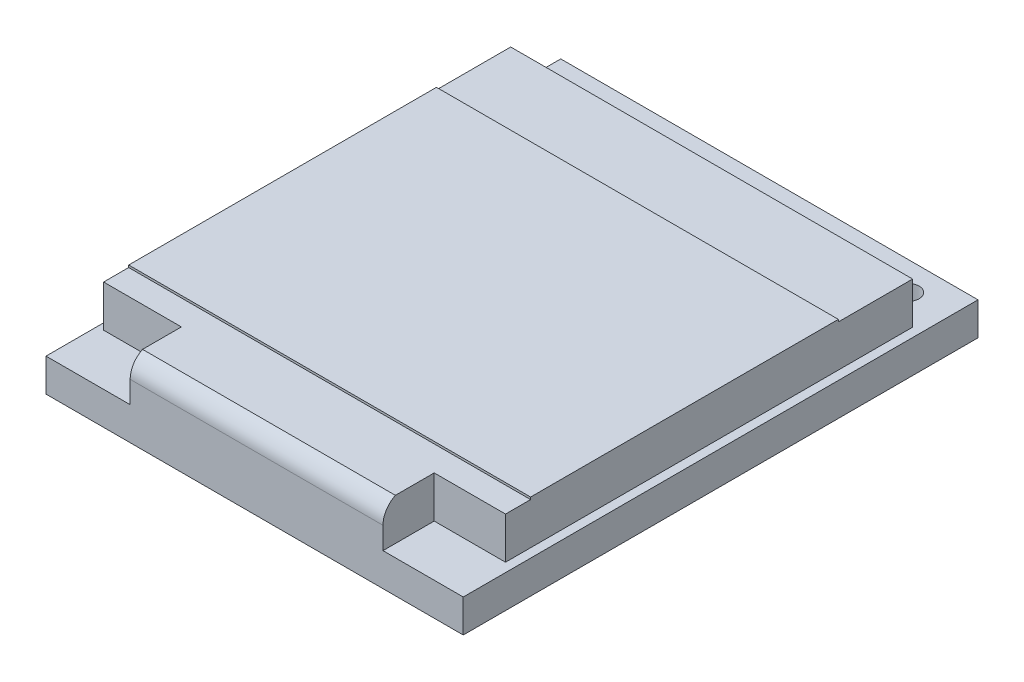
ISO-10303-21;
HEADER;
FILE_DESCRIPTION(('STEP AP214'),'2;1');
FILE_NAME('part.step','',(''),(''),'','','');
FILE_SCHEMA(('AUTOMOTIVE_DESIGN { 1 0 10303 214 1 1 1 1 }'));
ENDSEC;
DATA;
#1=APPLICATION_CONTEXT('core data for automotive mechanical design processes');
#2=APPLICATION_PROTOCOL_DEFINITION('international standard','automotive_design',2000,#1);
#3=PRODUCT_CONTEXT('',#1,'mechanical');
#4=PRODUCT('Part','Part','',(#3));
#5=PRODUCT_RELATED_PRODUCT_CATEGORY('part','',(#4));
#6=PRODUCT_DEFINITION_FORMATION('','',#4);
#7=PRODUCT_DEFINITION_CONTEXT('part definition',#1,'design');
#8=PRODUCT_DEFINITION('design','',#6,#7);
#9=PRODUCT_DEFINITION_SHAPE('','',#8);
#10=(LENGTH_UNIT() NAMED_UNIT(*) SI_UNIT(.MILLI.,.METRE.));
#11=(NAMED_UNIT(*) PLANE_ANGLE_UNIT() SI_UNIT($,.RADIAN.));
#12=(NAMED_UNIT(*) SI_UNIT($,.STERADIAN.) SOLID_ANGLE_UNIT());
#13=UNCERTAINTY_MEASURE_WITH_UNIT(LENGTH_MEASURE(1.E-05),#10,'distance_accuracy_value','');
#14=(GEOMETRIC_REPRESENTATION_CONTEXT(3) GLOBAL_UNCERTAINTY_ASSIGNED_CONTEXT((#13)) GLOBAL_UNIT_ASSIGNED_CONTEXT((#10,
#11,#12)) REPRESENTATION_CONTEXT('',''));
#15=CARTESIAN_POINT('',(0.,0.,0.));
#16=DIRECTION('',(0.,0.,1.));
#17=DIRECTION('',(1.,0.,0.));
#18=AXIS2_PLACEMENT_3D('',#15,#16,#17);
#19=CARTESIAN_POINT('',(0.290127114769082,3.5,2.56916476146928));
#20=DIRECTION('',(0.,0.,1.));
#21=DIRECTION('',(1.,0.,0.));
#22=AXIS2_PLACEMENT_3D('',#19,#20,#21);
#23=PLANE('',#22);
#24=DIRECTION('',(-1.,0.,0.));
#25=VECTOR('',#24,1.);
#26=CARTESIAN_POINT('',(0.290127114769082,3.4,2.56916476146928));
#27=LINE('',#26,#25);
#28=CARTESIAN_POINT('',(18.5917975918305,3.4,2.56916476146928));
#29=VERTEX_POINT('',#28);
#30=CARTESIAN_POINT('',(0.290127114769082,3.4,2.56916476146928));
#31=VERTEX_POINT('',#30);
#32=EDGE_CURVE('E202',#29,#31,#27,.T.);
#33=ORIENTED_EDGE('',*,*,#32,.F.);
#34=DIRECTION('',(0.,-1.,0.));
#35=VECTOR('',#34,1.);
#36=CARTESIAN_POINT('',(18.5917975918305,3.5,2.56916476146928));
#37=LINE('',#36,#35);
#38=CARTESIAN_POINT('',(18.5917975918305,1.5,2.56916476146928));
#39=VERTEX_POINT('',#38);
#40=EDGE_CURVE('E235',#29,#39,#37,.T.);
#41=ORIENTED_EDGE('',*,*,#40,.T.);
#42=DIRECTION('',(-1.,0.,0.));
#43=VECTOR('',#42,1.);
#44=CARTESIAN_POINT('',(0.290127114769082,1.5,2.56916476146928));
#45=LINE('',#44,#43);
#46=CARTESIAN_POINT('',(0.290127114769082,1.5,2.56916476146928));
#47=VERTEX_POINT('',#46);
#48=EDGE_CURVE('E212',#39,#47,#45,.T.);
#49=ORIENTED_EDGE('',*,*,#48,.T.);
#50=DIRECTION('',(0.,-1.,0.));
#51=VECTOR('',#50,1.);
#52=CARTESIAN_POINT('',(0.290127114769082,3.5,2.56916476146928));
#53=LINE('',#52,#51);
#54=EDGE_CURVE('E214',#31,#47,#53,.T.);
#55=ORIENTED_EDGE('',*,*,#54,.F.);
#56=EDGE_LOOP('',(#33,#41,#49,#55));
#57=FACE_BOUND('',#56,.T.);
#58=ADVANCED_FACE('F38',(#57),#23,.F.);
#59=CARTESIAN_POINT('',(0.,1.5,0.));
#60=DIRECTION('',(0.,1.,0.));
#61=DIRECTION('',(0.,0.,1.));
#62=AXIS2_PLACEMENT_3D('',#59,#60,#61);
#63=PLANE('',#62);
#64=DIRECTION('',(0.,0.,-1.));
#65=VECTOR('',#64,1.);
#66=CARTESIAN_POINT('',(15.3447270233196,1.5,21.1069858253315));
#67=LINE('',#66,#65);
#68=CARTESIAN_POINT('',(15.3447270233196,1.5,23.44));
#69=VERTEX_POINT('',#68);
#70=CARTESIAN_POINT('',(15.3447270233196,1.5,21.1069858253315));
#71=VERTEX_POINT('',#70);
#72=EDGE_CURVE('E223',#69,#71,#67,.T.);
#73=ORIENTED_EDGE('',*,*,#72,.F.);
#74=DIRECTION('',(1.,0.,0.));
#75=VECTOR('',#74,1.);
#76=CARTESIAN_POINT('',(0.,1.5,23.44));
#77=LINE('',#76,#75);
#78=CARTESIAN_POINT('',(19.,1.5,23.44));
#79=VERTEX_POINT('',#78);
#80=EDGE_CURVE('E295',#69,#79,#77,.T.);
#81=ORIENTED_EDGE('',*,*,#80,.T.);
#82=DIRECTION('',(0.,0.,-1.));
#83=VECTOR('',#82,1.);
#84=CARTESIAN_POINT('',(19.,1.5,0.));
#85=LINE('',#84,#83);
#86=CARTESIAN_POINT('',(19.,1.5,0.));
#87=VERTEX_POINT('',#86);
#88=EDGE_CURVE('E300',#79,#87,#85,.T.);
#89=ORIENTED_EDGE('',*,*,#88,.T.);
#90=DIRECTION('',(-1.,0.,0.));
#91=VECTOR('',#90,1.);
#92=CARTESIAN_POINT('',(0.,1.5,0.));
#93=LINE('',#92,#91);
#94=CARTESIAN_POINT('',(0.,1.5,0.));
#95=VERTEX_POINT('',#94);
#96=EDGE_CURVE('E302',#87,#95,#93,.T.);
#97=ORIENTED_EDGE('',*,*,#96,.T.);
#98=DIRECTION('',(0.,0.,1.));
#99=VECTOR('',#98,1.);
#100=CARTESIAN_POINT('',(0.,1.5,0.));
#101=LINE('',#100,#99);
#102=CARTESIAN_POINT('',(0.,1.5,23.44));
#103=VERTEX_POINT('',#102);
#104=EDGE_CURVE('E292',#95,#103,#101,.T.);
#105=ORIENTED_EDGE('',*,*,#104,.T.);
#106=CARTESIAN_POINT('',(3.83238591678098,1.5,23.44));
#107=VERTEX_POINT('',#106);
#108=EDGE_CURVE('E297',#103,#107,#77,.T.);
#109=ORIENTED_EDGE('',*,*,#108,.T.);
#110=DIRECTION('',(0.,0.,1.));
#111=VECTOR('',#110,1.);
#112=CARTESIAN_POINT('',(3.83238591678098,1.5,21.1069858253315));
#113=LINE('',#112,#111);
#114=CARTESIAN_POINT('',(3.83238591678098,1.5,21.1069858253315));
#115=VERTEX_POINT('',#114);
#116=EDGE_CURVE('E220',#115,#107,#113,.T.);
#117=ORIENTED_EDGE('',*,*,#116,.F.);
#118=DIRECTION('',(1.,0.,0.));
#119=VECTOR('',#118,1.);
#120=CARTESIAN_POINT('',(0.290127114769082,1.5,21.1069858253315));
#121=LINE('',#120,#119);
#122=CARTESIAN_POINT('',(0.290127114769082,1.5,21.1069858253315));
#123=VERTEX_POINT('',#122);
#124=EDGE_CURVE('E217',#123,#115,#121,.T.);
#125=ORIENTED_EDGE('',*,*,#124,.F.);
#126=DIRECTION('',(0.,0.,1.));
#127=VECTOR('',#126,1.);
#128=CARTESIAN_POINT('',(0.290127114769082,1.5,2.56916476146928));
#129=LINE('',#128,#127);
#130=EDGE_CURVE('E207',#47,#123,#129,.T.);
#131=ORIENTED_EDGE('',*,*,#130,.F.);
#132=ORIENTED_EDGE('',*,*,#48,.F.);
#133=DIRECTION('',(0.,0.,-1.));
#134=VECTOR('',#133,1.);
#135=CARTESIAN_POINT('',(18.5917975918305,1.5,2.56916476146928));
#136=LINE('',#135,#134);
#137=CARTESIAN_POINT('',(18.5917975918305,1.5,21.1069858253315));
#138=VERTEX_POINT('',#137);
#139=EDGE_CURVE('E229',#138,#39,#136,.T.);
#140=ORIENTED_EDGE('',*,*,#139,.F.);
#141=DIRECTION('',(1.,0.,0.));
#142=VECTOR('',#141,1.);
#143=CARTESIAN_POINT('',(15.3447270233196,1.5,21.1069858253315));
#144=LINE('',#143,#142);
#145=EDGE_CURVE('E226',#71,#138,#144,.T.);
#146=ORIENTED_EDGE('',*,*,#145,.F.);
#147=EDGE_LOOP('',(#73,#81,#89,#97,#105,#109,#117,#125,#131,#132,#140,#146));
#148=FACE_BOUND('',#147,.T.);
#149=CARTESIAN_POINT('',(14.58,1.5,1.3));
#150=DIRECTION('',(0.,1.,0.));
#151=DIRECTION('',(0.,0.,1.));
#152=AXIS2_PLACEMENT_3D('',#149,#150,#151);
#153=CIRCLE('',#152,0.500000000000001);
#154=CARTESIAN_POINT('',(14.58,1.5,1.8));
#155=VERTEX_POINT('',#154);
#156=EDGE_CURVE('E256',#155,#155,#153,.T.);
#157=ORIENTED_EDGE('',*,*,#156,.F.);
#158=EDGE_LOOP('',(#157));
#159=FACE_BOUND('',#158,.T.);
#160=CARTESIAN_POINT('',(9.5,1.5,1.3));
#161=DIRECTION('',(0.,1.,0.));
#162=DIRECTION('',(0.,0.,1.));
#163=AXIS2_PLACEMENT_3D('',#160,#161,#162);
#164=CIRCLE('',#163,0.500000000000001);
#165=CARTESIAN_POINT('',(9.5,1.5,1.8));
#166=VERTEX_POINT('',#165);
#167=EDGE_CURVE('E268',#166,#166,#164,.T.);
#168=ORIENTED_EDGE('',*,*,#167,.F.);
#169=EDGE_LOOP('',(#168));
#170=FACE_BOUND('',#169,.T.);
#171=CARTESIAN_POINT('',(4.42,1.5,1.3));
#172=DIRECTION('',(0.,1.,0.));
#173=DIRECTION('',(0.,0.,1.));
#174=AXIS2_PLACEMENT_3D('',#171,#172,#173);
#175=CIRCLE('',#174,0.500000000000001);
#176=CARTESIAN_POINT('',(4.42,1.5,1.8));
#177=VERTEX_POINT('',#176);
#178=EDGE_CURVE('E280',#177,#177,#175,.T.);
#179=ORIENTED_EDGE('',*,*,#178,.F.);
#180=EDGE_LOOP('',(#179));
#181=FACE_BOUND('',#180,.T.);
#182=CARTESIAN_POINT('',(1.88,1.5,1.3));
#183=DIRECTION('',(0.,1.,0.));
#184=DIRECTION('',(0.,0.,1.));
#185=AXIS2_PLACEMENT_3D('',#182,#183,#184);
#186=CIRCLE('',#185,0.499999999999999);
#187=CARTESIAN_POINT('',(1.88,1.5,1.8));
#188=VERTEX_POINT('',#187);
#189=EDGE_CURVE('E286',#188,#188,#186,.T.);
#190=ORIENTED_EDGE('',*,*,#189,.F.);
#191=EDGE_LOOP('',(#190));
#192=FACE_BOUND('',#191,.T.);
#193=CARTESIAN_POINT('',(6.96,1.5,1.3));
#194=DIRECTION('',(0.,1.,0.));
#195=DIRECTION('',(0.,0.,1.));
#196=AXIS2_PLACEMENT_3D('',#193,#194,#195);
#197=CIRCLE('',#196,0.5);
#198=CARTESIAN_POINT('',(6.96,1.5,1.8));
#199=VERTEX_POINT('',#198);
#200=EDGE_CURVE('E274',#199,#199,#197,.T.);
#201=ORIENTED_EDGE('',*,*,#200,.F.);
#202=EDGE_LOOP('',(#201));
#203=FACE_BOUND('',#202,.T.);
#204=CARTESIAN_POINT('',(12.04,1.5,1.3));
#205=DIRECTION('',(0.,1.,0.));
#206=DIRECTION('',(0.,0.,1.));
#207=AXIS2_PLACEMENT_3D('',#204,#205,#206);
#208=CIRCLE('',#207,0.500000000000001);
#209=CARTESIAN_POINT('',(12.04,1.5,1.8));
#210=VERTEX_POINT('',#209);
#211=EDGE_CURVE('E262',#210,#210,#208,.T.);
#212=ORIENTED_EDGE('',*,*,#211,.F.);
#213=EDGE_LOOP('',(#212));
#214=FACE_BOUND('',#213,.T.);
#215=CARTESIAN_POINT('',(17.12,1.5,1.3));
#216=DIRECTION('',(0.,1.,0.));
#217=DIRECTION('',(0.,0.,1.));
#218=AXIS2_PLACEMENT_3D('',#215,#216,#217);
#219=CIRCLE('',#218,0.499999999999999);
#220=CARTESIAN_POINT('',(17.12,1.5,1.8));
#221=VERTEX_POINT('',#220);
#222=EDGE_CURVE('E250',#221,#221,#219,.T.);
#223=ORIENTED_EDGE('',*,*,#222,.F.);
#224=EDGE_LOOP('',(#223));
#225=FACE_BOUND('',#224,.T.);
#226=ADVANCED_FACE('F345',(#148,#159,#170,#181,#192,#203,#214,#225),#63,.T.);
#227=CARTESIAN_POINT('',(0.,0.,0.));
#228=DIRECTION('',(0.,1.,0.));
#229=DIRECTION('',(0.,0.,1.));
#230=AXIS2_PLACEMENT_3D('',#227,#228,#229);
#231=PLANE('',#230);
#232=DIRECTION('',(0.,0.,1.));
#233=VECTOR('',#232,1.);
#234=CARTESIAN_POINT('',(0.,0.,0.));
#235=LINE('',#234,#233);
#236=CARTESIAN_POINT('',(0.,0.,0.));
#237=VERTEX_POINT('',#236);
#238=CARTESIAN_POINT('',(0.,0.,23.44));
#239=VERTEX_POINT('',#238);
#240=EDGE_CURVE('E289',#237,#239,#235,.T.);
#241=ORIENTED_EDGE('',*,*,#240,.F.);
#242=DIRECTION('',(-1.,0.,0.));
#243=VECTOR('',#242,1.);
#244=CARTESIAN_POINT('',(0.,0.,0.));
#245=LINE('',#244,#243);
#246=CARTESIAN_POINT('',(19.,0.,0.));
#247=VERTEX_POINT('',#246);
#248=EDGE_CURVE('E296',#247,#237,#245,.T.);
#249=ORIENTED_EDGE('',*,*,#248,.F.);
#250=DIRECTION('',(0.,0.,-1.));
#251=VECTOR('',#250,1.);
#252=CARTESIAN_POINT('',(19.,0.,0.));
#253=LINE('',#252,#251);
#254=CARTESIAN_POINT('',(19.,0.,23.44));
#255=VERTEX_POINT('',#254);
#256=EDGE_CURVE('E309',#255,#247,#253,.T.);
#257=ORIENTED_EDGE('',*,*,#256,.F.);
#258=DIRECTION('',(1.,0.,0.));
#259=VECTOR('',#258,1.);
#260=CARTESIAN_POINT('',(0.,0.,23.44));
#261=LINE('',#260,#259);
#262=EDGE_CURVE('E307',#239,#255,#261,.T.);
#263=ORIENTED_EDGE('',*,*,#262,.F.);
#264=EDGE_LOOP('',(#241,#249,#257,#263));
#265=FACE_BOUND('',#264,.T.);
#266=CARTESIAN_POINT('',(1.88,0.,1.3));
#267=DIRECTION('',(0.,1.,0.));
#268=DIRECTION('',(0.,0.,1.));
#269=AXIS2_PLACEMENT_3D('',#266,#267,#268);
#270=CIRCLE('',#269,0.499999999999999);
#271=CARTESIAN_POINT('',(1.88,0.,1.8));
#272=VERTEX_POINT('',#271);
#273=EDGE_CURVE('E283',#272,#272,#270,.T.);
#274=ORIENTED_EDGE('',*,*,#273,.T.);
#275=EDGE_LOOP('',(#274));
#276=FACE_BOUND('',#275,.T.);
#277=CARTESIAN_POINT('',(4.42,0.,1.3));
#278=DIRECTION('',(0.,1.,0.));
#279=DIRECTION('',(0.,0.,1.));
#280=AXIS2_PLACEMENT_3D('',#277,#278,#279);
#281=CIRCLE('',#280,0.500000000000001);
#282=CARTESIAN_POINT('',(4.42,0.,1.8));
#283=VERTEX_POINT('',#282);
#284=EDGE_CURVE('E277',#283,#283,#281,.T.);
#285=ORIENTED_EDGE('',*,*,#284,.T.);
#286=EDGE_LOOP('',(#285));
#287=FACE_BOUND('',#286,.T.);
#288=CARTESIAN_POINT('',(6.96,0.,1.3));
#289=DIRECTION('',(0.,1.,0.));
#290=DIRECTION('',(0.,0.,1.));
#291=AXIS2_PLACEMENT_3D('',#288,#289,#290);
#292=CIRCLE('',#291,0.5);
#293=CARTESIAN_POINT('',(6.96,0.,1.8));
#294=VERTEX_POINT('',#293);
#295=EDGE_CURVE('E271',#294,#294,#292,.T.);
#296=ORIENTED_EDGE('',*,*,#295,.T.);
#297=EDGE_LOOP('',(#296));
#298=FACE_BOUND('',#297,.T.);
#299=CARTESIAN_POINT('',(9.5,0.,1.3));
#300=DIRECTION('',(0.,1.,0.));
#301=DIRECTION('',(0.,0.,1.));
#302=AXIS2_PLACEMENT_3D('',#299,#300,#301);
#303=CIRCLE('',#302,0.500000000000001);
#304=CARTESIAN_POINT('',(9.5,0.,1.8));
#305=VERTEX_POINT('',#304);
#306=EDGE_CURVE('E265',#305,#305,#303,.T.);
#307=ORIENTED_EDGE('',*,*,#306,.T.);
#308=EDGE_LOOP('',(#307));
#309=FACE_BOUND('',#308,.T.);
#310=CARTESIAN_POINT('',(12.04,0.,1.3));
#311=DIRECTION('',(0.,1.,0.));
#312=DIRECTION('',(0.,0.,1.));
#313=AXIS2_PLACEMENT_3D('',#310,#311,#312);
#314=CIRCLE('',#313,0.500000000000001);
#315=CARTESIAN_POINT('',(12.04,0.,1.8));
#316=VERTEX_POINT('',#315);
#317=EDGE_CURVE('E259',#316,#316,#314,.T.);
#318=ORIENTED_EDGE('',*,*,#317,.T.);
#319=EDGE_LOOP('',(#318));
#320=FACE_BOUND('',#319,.T.);
#321=CARTESIAN_POINT('',(14.58,0.,1.3));
#322=DIRECTION('',(0.,1.,0.));
#323=DIRECTION('',(0.,0.,1.));
#324=AXIS2_PLACEMENT_3D('',#321,#322,#323);
#325=CIRCLE('',#324,0.500000000000001);
#326=CARTESIAN_POINT('',(14.58,0.,1.8));
#327=VERTEX_POINT('',#326);
#328=EDGE_CURVE('E253',#327,#327,#325,.T.);
#329=ORIENTED_EDGE('',*,*,#328,.T.);
#330=EDGE_LOOP('',(#329));
#331=FACE_BOUND('',#330,.T.);
#332=CARTESIAN_POINT('',(17.12,0.,1.3));
#333=DIRECTION('',(0.,1.,0.));
#334=DIRECTION('',(0.,0.,1.));
#335=AXIS2_PLACEMENT_3D('',#332,#333,#334);
#336=CIRCLE('',#335,0.499999999999999);
#337=CARTESIAN_POINT('',(17.12,0.,1.8));
#338=VERTEX_POINT('',#337);
#339=EDGE_CURVE('E249',#338,#338,#336,.T.);
#340=ORIENTED_EDGE('',*,*,#339,.T.);
#341=EDGE_LOOP('',(#340));
#342=FACE_BOUND('',#341,.T.);
#343=ADVANCED_FACE('F377',(#265,#276,#287,#298,#309,#320,#331,#342),#231,.F.);
#344=CARTESIAN_POINT('',(0.,1.5,0.));
#345=DIRECTION('',(1.,0.,0.));
#346=DIRECTION('',(0.,0.,-1.));
#347=AXIS2_PLACEMENT_3D('',#344,#345,#346);
#348=PLANE('',#347);
#349=ORIENTED_EDGE('',*,*,#240,.T.);
#350=DIRECTION('',(0.,-1.,0.));
#351=VECTOR('',#350,1.);
#352=CARTESIAN_POINT('',(0.,1.5,23.44));
#353=LINE('',#352,#351);
#354=EDGE_CURVE('E320',#103,#239,#353,.T.);
#355=ORIENTED_EDGE('',*,*,#354,.F.);
#356=ORIENTED_EDGE('',*,*,#104,.F.);
#357=DIRECTION('',(0.,-1.,0.));
#358=VECTOR('',#357,1.);
#359=CARTESIAN_POINT('',(0.,1.5,0.));
#360=LINE('',#359,#358);
#361=EDGE_CURVE('E304',#95,#237,#360,.T.);
#362=ORIENTED_EDGE('',*,*,#361,.T.);
#363=EDGE_LOOP('',(#349,#355,#356,#362));
#364=FACE_BOUND('',#363,.T.);
#365=ADVANCED_FACE('F425',(#364),#348,.F.);
#366=CARTESIAN_POINT('',(0.,1.5,23.44));
#367=DIRECTION('',(0.,0.,-1.));
#368=DIRECTION('',(-1.,0.,0.));
#369=AXIS2_PLACEMENT_3D('',#366,#367,#368);
#370=PLANE('',#369);
#371=DIRECTION('',(0.,-1.,0.));
#372=VECTOR('',#371,1.);
#373=CARTESIAN_POINT('',(15.3447270233196,3.5,23.44));
#374=LINE('',#373,#372);
#375=CARTESIAN_POINT('',(15.3447270233196,2.5,23.44));
#376=VERTEX_POINT('',#375);
#377=EDGE_CURVE('E241',#376,#69,#374,.T.);
#378=ORIENTED_EDGE('',*,*,#377,.F.);
#379=DIRECTION('',(1.,0.,0.));
#380=VECTOR('',#379,1.);
#381=CARTESIAN_POINT('',(3.83238591678098,2.5,23.44));
#382=LINE('',#381,#380);
#383=CARTESIAN_POINT('',(3.83238591678098,2.5,23.44));
#384=VERTEX_POINT('',#383);
#385=EDGE_CURVE('E325',#376,#384,#382,.F.);
#386=ORIENTED_EDGE('',*,*,#385,.T.);
#387=DIRECTION('',(0.,-1.,0.));
#388=VECTOR('',#387,1.);
#389=CARTESIAN_POINT('',(3.83238591678098,3.5,23.44));
#390=LINE('',#389,#388);
#391=EDGE_CURVE('E243',#384,#107,#390,.T.);
#392=ORIENTED_EDGE('',*,*,#391,.T.);
#393=ORIENTED_EDGE('',*,*,#108,.F.);
#394=ORIENTED_EDGE('',*,*,#354,.T.);
#395=ORIENTED_EDGE('',*,*,#262,.T.);
#396=DIRECTION('',(0.,-1.,0.));
#397=VECTOR('',#396,1.);
#398=CARTESIAN_POINT('',(19.,1.5,23.44));
#399=LINE('',#398,#397);
#400=EDGE_CURVE('E317',#79,#255,#399,.T.);
#401=ORIENTED_EDGE('',*,*,#400,.F.);
#402=ORIENTED_EDGE('',*,*,#80,.F.);
#403=EDGE_LOOP('',(#378,#386,#392,#393,#394,#395,#401,#402));
#404=FACE_BOUND('',#403,.T.);
#405=ADVANCED_FACE('F433',(#404),#370,.F.);
#406=CARTESIAN_POINT('',(19.,1.5,0.));
#407=DIRECTION('',(-1.,0.,0.));
#408=DIRECTION('',(0.,0.,1.));
#409=AXIS2_PLACEMENT_3D('',#406,#407,#408);
#410=PLANE('',#409);
#411=ORIENTED_EDGE('',*,*,#256,.T.);
#412=DIRECTION('',(0.,-1.,0.));
#413=VECTOR('',#412,1.);
#414=CARTESIAN_POINT('',(19.,1.5,0.));
#415=LINE('',#414,#413);
#416=EDGE_CURVE('E314',#87,#247,#415,.T.);
#417=ORIENTED_EDGE('',*,*,#416,.F.);
#418=ORIENTED_EDGE('',*,*,#88,.F.);
#419=ORIENTED_EDGE('',*,*,#400,.T.);
#420=EDGE_LOOP('',(#411,#417,#418,#419));
#421=FACE_BOUND('',#420,.T.);
#422=ADVANCED_FACE('F429',(#421),#410,.F.);
#423=CARTESIAN_POINT('',(0.,1.5,0.));
#424=DIRECTION('',(0.,0.,1.));
#425=DIRECTION('',(1.,0.,0.));
#426=AXIS2_PLACEMENT_3D('',#423,#424,#425);
#427=PLANE('',#426);
#428=ORIENTED_EDGE('',*,*,#248,.T.);
#429=ORIENTED_EDGE('',*,*,#361,.F.);
#430=ORIENTED_EDGE('',*,*,#96,.F.);
#431=ORIENTED_EDGE('',*,*,#416,.T.);
#432=EDGE_LOOP('',(#428,#429,#430,#431));
#433=FACE_BOUND('',#432,.T.);
#434=ADVANCED_FACE('F420',(#433),#427,.F.);
#435=CARTESIAN_POINT('',(1.88,1.5,1.3));
#436=DIRECTION('',(0.,-1.,0.));
#437=DIRECTION('',(0.,0.,-1.));
#438=AXIS2_PLACEMENT_3D('',#435,#436,#437);
#439=CYLINDRICAL_SURFACE('',#438,0.499999999999999);
#440=ORIENTED_EDGE('',*,*,#189,.T.);
#441=EDGE_LOOP('',(#440));
#442=FACE_BOUND('',#441,.T.);
#443=ORIENTED_EDGE('',*,*,#273,.F.);
#444=EDGE_LOOP('',(#443));
#445=FACE_BOUND('',#444,.T.);
#446=ADVANCED_FACE('F417',(#442,#445),#439,.F.);
#447=CARTESIAN_POINT('',(4.42,1.5,1.3));
#448=DIRECTION('',(0.,-1.,0.));
#449=DIRECTION('',(0.,0.,-1.));
#450=AXIS2_PLACEMENT_3D('',#447,#448,#449);
#451=CYLINDRICAL_SURFACE('',#450,0.500000000000001);
#452=ORIENTED_EDGE('',*,*,#178,.T.);
#453=EDGE_LOOP('',(#452));
#454=FACE_BOUND('',#453,.T.);
#455=ORIENTED_EDGE('',*,*,#284,.F.);
#456=EDGE_LOOP('',(#455));
#457=FACE_BOUND('',#456,.T.);
#458=ADVANCED_FACE('F413',(#454,#457),#451,.F.);
#459=CARTESIAN_POINT('',(6.96,1.5,1.3));
#460=DIRECTION('',(0.,-1.,0.));
#461=DIRECTION('',(0.,0.,-1.));
#462=AXIS2_PLACEMENT_3D('',#459,#460,#461);
#463=CYLINDRICAL_SURFACE('',#462,0.5);
#464=ORIENTED_EDGE('',*,*,#200,.T.);
#465=EDGE_LOOP('',(#464));
#466=FACE_BOUND('',#465,.T.);
#467=ORIENTED_EDGE('',*,*,#295,.F.);
#468=EDGE_LOOP('',(#467));
#469=FACE_BOUND('',#468,.T.);
#470=ADVANCED_FACE('F409',(#466,#469),#463,.F.);
#471=CARTESIAN_POINT('',(9.5,1.5,1.3));
#472=DIRECTION('',(0.,-1.,0.));
#473=DIRECTION('',(0.,0.,-1.));
#474=AXIS2_PLACEMENT_3D('',#471,#472,#473);
#475=CYLINDRICAL_SURFACE('',#474,0.500000000000001);
#476=ORIENTED_EDGE('',*,*,#167,.T.);
#477=EDGE_LOOP('',(#476));
#478=FACE_BOUND('',#477,.T.);
#479=ORIENTED_EDGE('',*,*,#306,.F.);
#480=EDGE_LOOP('',(#479));
#481=FACE_BOUND('',#480,.T.);
#482=ADVANCED_FACE('F405',(#478,#481),#475,.F.);
#483=CARTESIAN_POINT('',(12.04,1.5,1.3));
#484=DIRECTION('',(0.,-1.,0.));
#485=DIRECTION('',(0.,0.,-1.));
#486=AXIS2_PLACEMENT_3D('',#483,#484,#485);
#487=CYLINDRICAL_SURFACE('',#486,0.500000000000001);
#488=ORIENTED_EDGE('',*,*,#211,.T.);
#489=EDGE_LOOP('',(#488));
#490=FACE_BOUND('',#489,.T.);
#491=ORIENTED_EDGE('',*,*,#317,.F.);
#492=EDGE_LOOP('',(#491));
#493=FACE_BOUND('',#492,.T.);
#494=ADVANCED_FACE('F401',(#490,#493),#487,.F.);
#495=CARTESIAN_POINT('',(14.58,1.5,1.3));
#496=DIRECTION('',(0.,-1.,0.));
#497=DIRECTION('',(0.,0.,-1.));
#498=AXIS2_PLACEMENT_3D('',#495,#496,#497);
#499=CYLINDRICAL_SURFACE('',#498,0.500000000000001);
#500=ORIENTED_EDGE('',*,*,#156,.T.);
#501=EDGE_LOOP('',(#500));
#502=FACE_BOUND('',#501,.T.);
#503=ORIENTED_EDGE('',*,*,#328,.F.);
#504=EDGE_LOOP('',(#503));
#505=FACE_BOUND('',#504,.T.);
#506=ADVANCED_FACE('F397',(#502,#505),#499,.F.);
#507=CARTESIAN_POINT('',(17.12,1.5,1.3));
#508=DIRECTION('',(0.,-1.,0.));
#509=DIRECTION('',(0.,0.,-1.));
#510=AXIS2_PLACEMENT_3D('',#507,#508,#509);
#511=CYLINDRICAL_SURFACE('',#510,0.499999999999999);
#512=ORIENTED_EDGE('',*,*,#222,.T.);
#513=EDGE_LOOP('',(#512));
#514=FACE_BOUND('',#513,.T.);
#515=ORIENTED_EDGE('',*,*,#339,.F.);
#516=EDGE_LOOP('',(#515));
#517=FACE_BOUND('',#516,.T.);
#518=ADVANCED_FACE('F394',(#514,#517),#511,.F.);
#519=CARTESIAN_POINT('',(0.290127114769082,3.5,2.56916476146928));
#520=DIRECTION('',(1.,0.,0.));
#521=DIRECTION('',(0.,0.,-1.));
#522=AXIS2_PLACEMENT_3D('',#519,#520,#521);
#523=PLANE('',#522);
#524=DIRECTION('',(0.,0.,1.));
#525=VECTOR('',#524,1.);
#526=CARTESIAN_POINT('',(0.290127114769082,3.4,19.9644916456382));
#527=LINE('',#526,#525);
#528=CARTESIAN_POINT('',(0.290127114769082,3.4,19.9644916456382));
#529=VERTEX_POINT('',#528);
#530=CARTESIAN_POINT('',(0.290127114769081,3.4,21.1069858253315));
#531=VERTEX_POINT('',#530);
#532=EDGE_CURVE('E174',#529,#531,#527,.T.);
#533=ORIENTED_EDGE('',*,*,#532,.F.);
#534=DIRECTION('',(0.,1.,0.));
#535=VECTOR('',#534,1.);
#536=CARTESIAN_POINT('',(0.290127114769082,3.4,19.9644916456382));
#537=LINE('',#536,#535);
#538=CARTESIAN_POINT('',(0.290127114769082,3.5,19.9644916456382));
#539=VERTEX_POINT('',#538);
#540=EDGE_CURVE('E173',#529,#539,#537,.T.);
#541=ORIENTED_EDGE('',*,*,#540,.T.);
#542=DIRECTION('',(0.,0.,1.));
#543=VECTOR('',#542,1.);
#544=CARTESIAN_POINT('',(0.290127114769082,3.5,2.56916476146928));
#545=LINE('',#544,#543);
#546=CARTESIAN_POINT('',(0.290127114769082,3.5,5.9497940252366));
#547=VERTEX_POINT('',#546);
#548=EDGE_CURVE('E209',#547,#539,#545,.T.);
#549=ORIENTED_EDGE('',*,*,#548,.F.);
#550=DIRECTION('',(0.,1.,0.));
#551=VECTOR('',#550,1.);
#552=CARTESIAN_POINT('',(0.290127114769082,3.4,5.9497940252366));
#553=LINE('',#552,#551);
#554=CARTESIAN_POINT('',(0.290127114769082,3.4,5.9497940252366));
#555=VERTEX_POINT('',#554);
#556=EDGE_CURVE('E60',#555,#547,#553,.T.);
#557=ORIENTED_EDGE('',*,*,#556,.F.);
#558=DIRECTION('',(0.,0.,1.));
#559=VECTOR('',#558,1.);
#560=CARTESIAN_POINT('',(0.290127114769082,3.4,2.56916476146928));
#561=LINE('',#560,#559);
#562=EDGE_CURVE('E194',#31,#555,#561,.T.);
#563=ORIENTED_EDGE('',*,*,#562,.F.);
#564=ORIENTED_EDGE('',*,*,#54,.T.);
#565=ORIENTED_EDGE('',*,*,#130,.T.);
#566=DIRECTION('',(0.,-1.,0.));
#567=VECTOR('',#566,1.);
#568=CARTESIAN_POINT('',(0.290127114769082,3.5,21.1069858253315));
#569=LINE('',#568,#567);
#570=EDGE_CURVE('E247',#531,#123,#569,.T.);
#571=ORIENTED_EDGE('',*,*,#570,.F.);
#572=EDGE_LOOP('',(#533,#541,#549,#557,#563,#564,#565,#571));
#573=FACE_BOUND('',#572,.T.);
#574=ADVANCED_FACE('F359',(#573),#523,.F.);
#575=CARTESIAN_POINT('',(0.290127114769082,3.5,21.1069858253315));
#576=DIRECTION('',(0.,0.,-1.));
#577=DIRECTION('',(-1.,0.,0.));
#578=AXIS2_PLACEMENT_3D('',#575,#576,#577);
#579=PLANE('',#578);
#580=DIRECTION('',(0.,-1.,0.));
#581=VECTOR('',#580,1.);
#582=CARTESIAN_POINT('',(3.83238591678098,3.5,21.1069858253315));
#583=LINE('',#582,#581);
#584=CARTESIAN_POINT('',(3.83238591678098,3.4,21.1069858253315));
#585=VERTEX_POINT('',#584);
#586=EDGE_CURVE('E245',#585,#115,#583,.T.);
#587=ORIENTED_EDGE('',*,*,#586,.F.);
#588=DIRECTION('',(-1.,0.,0.));
#589=VECTOR('',#588,1.);
#590=CARTESIAN_POINT('',(0.290127114769082,3.4,21.1069858253315));
#591=LINE('',#590,#589);
#592=EDGE_CURVE('E189',#585,#531,#591,.T.);
#593=ORIENTED_EDGE('',*,*,#592,.T.);
#594=ORIENTED_EDGE('',*,*,#570,.T.);
#595=ORIENTED_EDGE('',*,*,#124,.T.);
#596=EDGE_LOOP('',(#587,#593,#594,#595));
#597=FACE_BOUND('',#596,.T.);
#598=ADVANCED_FACE('F388',(#597),#579,.F.);
#599=CARTESIAN_POINT('',(3.83238591678098,3.5,21.1069858253315));
#600=DIRECTION('',(1.,0.,0.));
#601=DIRECTION('',(0.,0.,-1.));
#602=AXIS2_PLACEMENT_3D('',#599,#600,#601);
#603=PLANE('',#602);
#604=CARTESIAN_POINT('',(3.83238591678098,2.5,22.44));
#605=DIRECTION('',(1.,0.,0.));
#606=DIRECTION('',(0.,0.,-1.));
#607=AXIS2_PLACEMENT_3D('',#604,#605,#606);
#608=CIRCLE('',#607,1.);
#609=CARTESIAN_POINT('',(3.83238591678098,3.4,22.8758898943541));
#610=VERTEX_POINT('',#609);
#611=EDGE_CURVE('E46',#384,#610,#608,.F.);
#612=ORIENTED_EDGE('',*,*,#611,.T.);
#613=DIRECTION('',(0.,0.,-1.));
#614=VECTOR('',#613,1.);
#615=CARTESIAN_POINT('',(3.83238591678098,3.4,21.1069858253315));
#616=LINE('',#615,#614);
#617=EDGE_CURVE('E52',#610,#585,#616,.T.);
#618=ORIENTED_EDGE('',*,*,#617,.T.);
#619=ORIENTED_EDGE('',*,*,#586,.T.);
#620=ORIENTED_EDGE('',*,*,#116,.T.);
#621=ORIENTED_EDGE('',*,*,#391,.F.);
#622=EDGE_LOOP('',(#612,#618,#619,#620,#621));
#623=FACE_BOUND('',#622,.T.);
#624=ADVANCED_FACE('F330',(#623),#603,.F.);
#625=CARTESIAN_POINT('',(15.3447270233196,3.5,21.1069858253315));
#626=DIRECTION('',(-1.,0.,0.));
#627=DIRECTION('',(0.,0.,1.));
#628=AXIS2_PLACEMENT_3D('',#625,#626,#627);
#629=PLANE('',#628);
#630=DIRECTION('',(0.,-1.,0.));
#631=VECTOR('',#630,1.);
#632=CARTESIAN_POINT('',(15.3447270233196,3.5,21.1069858253315));
#633=LINE('',#632,#631);
#634=CARTESIAN_POINT('',(15.3447270233196,3.4,21.1069858253315));
#635=VERTEX_POINT('',#634);
#636=EDGE_CURVE('E239',#635,#71,#633,.T.);
#637=ORIENTED_EDGE('',*,*,#636,.F.);
#638=DIRECTION('',(0.,0.,1.));
#639=VECTOR('',#638,1.);
#640=CARTESIAN_POINT('',(15.3447270233196,3.4,21.1069858253315));
#641=LINE('',#640,#639);
#642=CARTESIAN_POINT('',(15.3447270233196,3.4,22.8758898943541));
#643=VERTEX_POINT('',#642);
#644=EDGE_CURVE('E181',#635,#643,#641,.T.);
#645=ORIENTED_EDGE('',*,*,#644,.T.);
#646=CARTESIAN_POINT('',(15.3447270233196,2.5,22.44));
#647=DIRECTION('',(-1.,0.,0.));
#648=DIRECTION('',(0.,0.,1.));
#649=AXIS2_PLACEMENT_3D('',#646,#647,#648);
#650=CIRCLE('',#649,1.);
#651=EDGE_CURVE('E323',#643,#376,#650,.F.);
#652=ORIENTED_EDGE('',*,*,#651,.T.);
#653=ORIENTED_EDGE('',*,*,#377,.T.);
#654=ORIENTED_EDGE('',*,*,#72,.T.);
#655=EDGE_LOOP('',(#637,#645,#652,#653,#654));
#656=FACE_BOUND('',#655,.T.);
#657=ADVANCED_FACE('F337',(#656),#629,.F.);
#658=CARTESIAN_POINT('',(15.3447270233196,3.5,21.1069858253315));
#659=DIRECTION('',(0.,0.,-1.));
#660=DIRECTION('',(-1.,0.,0.));
#661=AXIS2_PLACEMENT_3D('',#658,#659,#660);
#662=PLANE('',#661);
#663=DIRECTION('',(0.,-1.,0.));
#664=VECTOR('',#663,1.);
#665=CARTESIAN_POINT('',(18.5917975918305,3.5,21.1069858253315));
#666=LINE('',#665,#664);
#667=CARTESIAN_POINT('',(18.5917975918305,3.4,21.1069858253315));
#668=VERTEX_POINT('',#667);
#669=EDGE_CURVE('E237',#668,#138,#666,.T.);
#670=ORIENTED_EDGE('',*,*,#669,.F.);
#671=DIRECTION('',(-1.,0.,0.));
#672=VECTOR('',#671,1.);
#673=CARTESIAN_POINT('',(15.3447270233196,3.4,21.1069858253315));
#674=LINE('',#673,#672);
#675=EDGE_CURVE('E162',#668,#635,#674,.T.);
#676=ORIENTED_EDGE('',*,*,#675,.T.);
#677=ORIENTED_EDGE('',*,*,#636,.T.);
#678=ORIENTED_EDGE('',*,*,#145,.T.);
#679=EDGE_LOOP('',(#670,#676,#677,#678));
#680=FACE_BOUND('',#679,.T.);
#681=ADVANCED_FACE('F342',(#680),#662,.F.);
#682=CARTESIAN_POINT('',(18.5917975918305,3.5,2.56916476146928));
#683=DIRECTION('',(-1.,0.,0.));
#684=DIRECTION('',(0.,0.,1.));
#685=AXIS2_PLACEMENT_3D('',#682,#683,#684);
#686=PLANE('',#685);
#687=DIRECTION('',(0.,0.,-1.));
#688=VECTOR('',#687,1.);
#689=CARTESIAN_POINT('',(18.5917975918305,3.5,2.56916476146928));
#690=LINE('',#689,#688);
#691=CARTESIAN_POINT('',(18.5917975918305,3.5,19.9644916456382));
#692=VERTEX_POINT('',#691);
#693=CARTESIAN_POINT('',(18.5917975918305,3.5,5.9497940252366));
#694=VERTEX_POINT('',#693);
#695=EDGE_CURVE('E179',#692,#694,#690,.T.);
#696=ORIENTED_EDGE('',*,*,#695,.F.);
#697=DIRECTION('',(0.,1.,0.));
#698=VECTOR('',#697,1.);
#699=CARTESIAN_POINT('',(18.5917975918305,3.4,19.9644916456382));
#700=LINE('',#699,#698);
#701=CARTESIAN_POINT('',(18.5917975918305,3.4,19.9644916456382));
#702=VERTEX_POINT('',#701);
#703=EDGE_CURVE('E170',#702,#692,#700,.T.);
#704=ORIENTED_EDGE('',*,*,#703,.F.);
#705=DIRECTION('',(0.,0.,-1.));
#706=VECTOR('',#705,1.);
#707=CARTESIAN_POINT('',(18.5917975918305,3.4,19.9644916456382));
#708=LINE('',#707,#706);
#709=EDGE_CURVE('E156',#668,#702,#708,.T.);
#710=ORIENTED_EDGE('',*,*,#709,.F.);
#711=ORIENTED_EDGE('',*,*,#669,.T.);
#712=ORIENTED_EDGE('',*,*,#139,.T.);
#713=ORIENTED_EDGE('',*,*,#40,.F.);
#714=DIRECTION('',(0.,0.,-1.));
#715=VECTOR('',#714,1.);
#716=CARTESIAN_POINT('',(18.5917975918305,3.4,2.56916476146928));
#717=LINE('',#716,#715);
#718=CARTESIAN_POINT('',(18.5917975918305,3.4,5.9497940252366));
#719=VERTEX_POINT('',#718);
#720=EDGE_CURVE('E200',#719,#29,#717,.T.);
#721=ORIENTED_EDGE('',*,*,#720,.F.);
#722=DIRECTION('',(0.,1.,0.));
#723=VECTOR('',#722,1.);
#724=CARTESIAN_POINT('',(18.5917975918305,3.4,5.9497940252366));
#725=LINE('',#724,#723);
#726=EDGE_CURVE('E205',#719,#694,#725,.T.);
#727=ORIENTED_EDGE('',*,*,#726,.T.);
#728=EDGE_LOOP('',(#696,#704,#710,#711,#712,#713,#721,#727));
#729=FACE_BOUND('',#728,.T.);
#730=ADVANCED_FACE('F177',(#729),#686,.F.);
#731=CARTESIAN_POINT('',(0.,3.5,0.));
#732=DIRECTION('',(0.,1.,0.));
#733=DIRECTION('',(0.,0.,1.));
#734=AXIS2_PLACEMENT_3D('',#731,#732,#733);
#735=PLANE('',#734);
#736=DIRECTION('',(-1.,0.,0.));
#737=VECTOR('',#736,1.);
#738=CARTESIAN_POINT('',(18.5917975918305,3.5,19.9644916456382));
#739=LINE('',#738,#737);
#740=EDGE_CURVE('E166',#692,#539,#739,.T.);
#741=ORIENTED_EDGE('',*,*,#740,.F.);
#742=ORIENTED_EDGE('',*,*,#695,.T.);
#743=DIRECTION('',(1.,0.,0.));
#744=VECTOR('',#743,1.);
#745=CARTESIAN_POINT('',(0.290127114769082,3.5,5.9497940252366));
#746=LINE('',#745,#744);
#747=EDGE_CURVE('E193',#547,#694,#746,.T.);
#748=ORIENTED_EDGE('',*,*,#747,.F.);
#749=ORIENTED_EDGE('',*,*,#548,.T.);
#750=EDGE_LOOP('',(#741,#742,#748,#749));
#751=FACE_BOUND('',#750,.T.);
#752=ADVANCED_FACE('F362',(#751),#735,.T.);
#753=CARTESIAN_POINT('',(0.,2.5,22.44));
#754=DIRECTION('',(-1.,0.,0.));
#755=DIRECTION('',(0.,0.,1.));
#756=AXIS2_PLACEMENT_3D('',#753,#754,#755);
#757=CYLINDRICAL_SURFACE('',#756,1.);
#758=DIRECTION('',(-1.,0.,0.));
#759=VECTOR('',#758,1.);
#760=CARTESIAN_POINT('',(0.,3.4,22.8758898943541));
#761=LINE('',#760,#759);
#762=EDGE_CURVE('E11',#610,#643,#761,.F.);
#763=ORIENTED_EDGE('',*,*,#762,.F.);
#764=ORIENTED_EDGE('',*,*,#611,.F.);
#765=ORIENTED_EDGE('',*,*,#385,.F.);
#766=ORIENTED_EDGE('',*,*,#651,.F.);
#767=EDGE_LOOP('',(#763,#764,#765,#766));
#768=FACE_BOUND('',#767,.T.);
#769=ADVANCED_FACE('F40',(#768),#757,.T.);
#770=CARTESIAN_POINT('',(0.290127114769082,3.4,5.9497940252366));
#771=DIRECTION('',(0.,0.,1.));
#772=DIRECTION('',(1.,0.,0.));
#773=AXIS2_PLACEMENT_3D('',#770,#771,#772);
#774=PLANE('',#773);
#775=ORIENTED_EDGE('',*,*,#747,.T.);
#776=ORIENTED_EDGE('',*,*,#726,.F.);
#777=DIRECTION('',(1.,0.,0.));
#778=VECTOR('',#777,1.);
#779=CARTESIAN_POINT('',(0.290127114769082,3.4,5.9497940252366));
#780=LINE('',#779,#778);
#781=EDGE_CURVE('E197',#555,#719,#780,.T.);
#782=ORIENTED_EDGE('',*,*,#781,.F.);
#783=ORIENTED_EDGE('',*,*,#556,.T.);
#784=EDGE_LOOP('',(#775,#776,#782,#783));
#785=FACE_BOUND('',#784,.T.);
#786=ADVANCED_FACE('F363',(#785),#774,.F.);
#787=CARTESIAN_POINT('',(0.,3.4,0.));
#788=DIRECTION('',(0.,1.,0.));
#789=DIRECTION('',(0.,0.,1.));
#790=AXIS2_PLACEMENT_3D('',#787,#788,#789);
#791=PLANE('',#790);
#792=ORIENTED_EDGE('',*,*,#562,.T.);
#793=ORIENTED_EDGE('',*,*,#781,.T.);
#794=ORIENTED_EDGE('',*,*,#720,.T.);
#795=ORIENTED_EDGE('',*,*,#32,.T.);
#796=EDGE_LOOP('',(#792,#793,#794,#795));
#797=FACE_BOUND('',#796,.T.);
#798=ADVANCED_FACE('F357',(#797),#791,.T.);
#799=CARTESIAN_POINT('',(0.,3.4,0.));
#800=DIRECTION('',(0.,-1.,0.));
#801=DIRECTION('',(0.,0.,-1.));
#802=AXIS2_PLACEMENT_3D('',#799,#800,#801);
#803=PLANE('',#802);
#804=ORIENTED_EDGE('',*,*,#709,.T.);
#805=DIRECTION('',(-1.,0.,0.));
#806=VECTOR('',#805,1.);
#807=CARTESIAN_POINT('',(18.5917975918305,3.4,19.9644916456382));
#808=LINE('',#807,#806);
#809=EDGE_CURVE('E159',#702,#529,#808,.T.);
#810=ORIENTED_EDGE('',*,*,#809,.T.);
#811=ORIENTED_EDGE('',*,*,#532,.T.);
#812=ORIENTED_EDGE('',*,*,#592,.F.);
#813=ORIENTED_EDGE('',*,*,#617,.F.);
#814=ORIENTED_EDGE('',*,*,#762,.T.);
#815=ORIENTED_EDGE('',*,*,#644,.F.);
#816=ORIENTED_EDGE('',*,*,#675,.F.);
#817=EDGE_LOOP('',(#804,#810,#811,#812,#813,#814,#815,#816));
#818=FACE_BOUND('',#817,.T.);
#819=ADVANCED_FACE('F158',(#818),#803,.F.);
#820=CARTESIAN_POINT('',(18.5917975918305,3.4,19.9644916456382));
#821=DIRECTION('',(0.,0.,-1.));
#822=DIRECTION('',(-1.,0.,0.));
#823=AXIS2_PLACEMENT_3D('',#820,#821,#822);
#824=PLANE('',#823);
#825=ORIENTED_EDGE('',*,*,#740,.T.);
#826=ORIENTED_EDGE('',*,*,#540,.F.);
#827=ORIENTED_EDGE('',*,*,#809,.F.);
#828=ORIENTED_EDGE('',*,*,#703,.T.);
#829=EDGE_LOOP('',(#825,#826,#827,#828));
#830=FACE_BOUND('',#829,.T.);
#831=ADVANCED_FACE('F169',(#830),#824,.F.);
#832=CLOSED_SHELL('',(#58,#226,#343,#365,#405,#422,#434,#446,#458,#470,#482,#494,#506,#518,#574,
#598,#624,#657,#681,#730,#752,#769,#786,#798,#819,#831));
#833=MANIFOLD_SOLID_BREP('B2',#832);
#834=ADVANCED_BREP_SHAPE_REPRESENTATION('',(#18,#833),#14);
#835=SHAPE_DEFINITION_REPRESENTATION(#9,#834);
ENDSEC;
END-ISO-10303-21;
